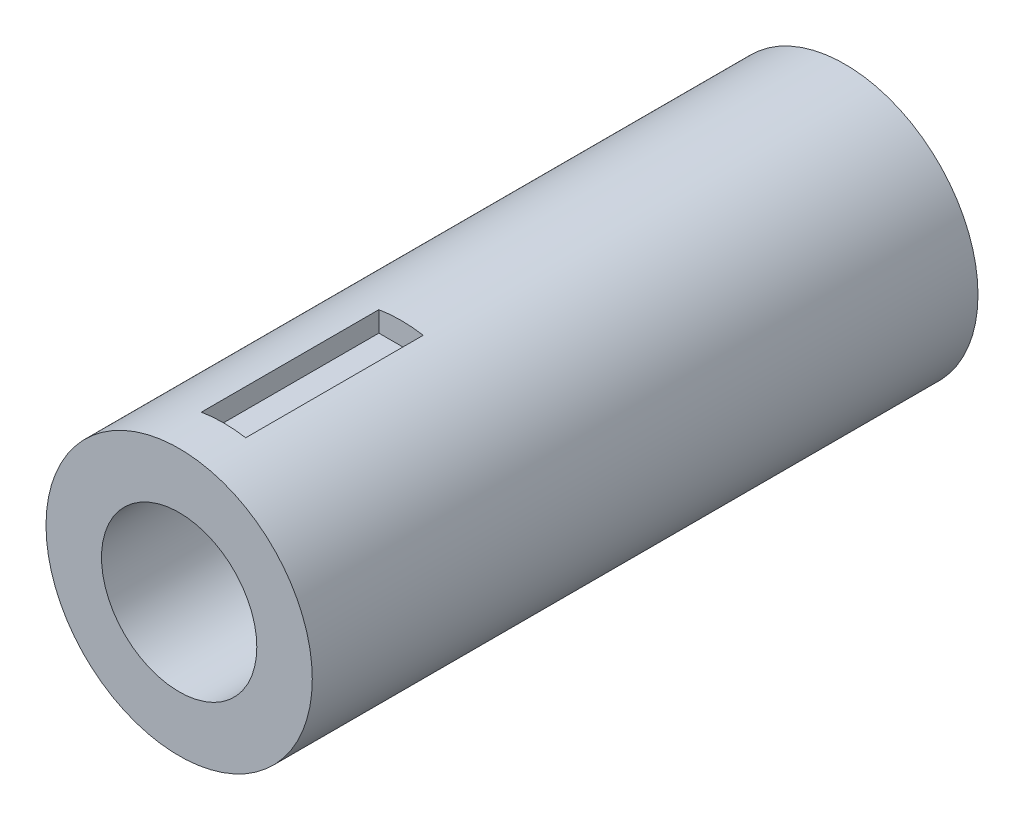
ISO-10303-21;
HEADER;
FILE_DESCRIPTION(('STEP AP214'),'2;1');
FILE_NAME('part.step','',(''),(''),'','','');
FILE_SCHEMA(('AUTOMOTIVE_DESIGN { 1 0 10303 214 1 1 1 1 }'));
ENDSEC;
DATA;
#1=APPLICATION_CONTEXT('core data for automotive mechanical design processes');
#2=APPLICATION_PROTOCOL_DEFINITION('international standard','automotive_design',2000,#1);
#3=PRODUCT_CONTEXT('',#1,'mechanical');
#4=PRODUCT('Part','Part','',(#3));
#5=PRODUCT_RELATED_PRODUCT_CATEGORY('part','',(#4));
#6=PRODUCT_DEFINITION_FORMATION('','',#4);
#7=PRODUCT_DEFINITION_CONTEXT('part definition',#1,'design');
#8=PRODUCT_DEFINITION('design','',#6,#7);
#9=PRODUCT_DEFINITION_SHAPE('','',#8);
#10=(LENGTH_UNIT() NAMED_UNIT(*) SI_UNIT(.MILLI.,.METRE.));
#11=(NAMED_UNIT(*) PLANE_ANGLE_UNIT() SI_UNIT($,.RADIAN.));
#12=(NAMED_UNIT(*) SI_UNIT($,.STERADIAN.) SOLID_ANGLE_UNIT());
#13=UNCERTAINTY_MEASURE_WITH_UNIT(LENGTH_MEASURE(1.E-05),#10,'distance_accuracy_value','');
#14=(GEOMETRIC_REPRESENTATION_CONTEXT(3) GLOBAL_UNCERTAINTY_ASSIGNED_CONTEXT((#13)) GLOBAL_UNIT_ASSIGNED_CONTEXT((#10,
#11,#12)) REPRESENTATION_CONTEXT('',''));
#15=CARTESIAN_POINT('',(0.,0.,0.));
#16=DIRECTION('',(0.,0.,1.));
#17=DIRECTION('',(1.,0.,0.));
#18=AXIS2_PLACEMENT_3D('',#15,#16,#17);
#19=CARTESIAN_POINT('',(0.,0.,-30.));
#20=DIRECTION('',(0.,0.,1.));
#21=DIRECTION('',(1.,0.,0.));
#22=AXIS2_PLACEMENT_3D('',#19,#20,#21);
#23=CYLINDRICAL_SURFACE('',#22,6.);
#24=CARTESIAN_POINT('',(0.,0.,-2.));
#25=DIRECTION('',(0.,0.,1.));
#26=DIRECTION('',(1.,0.,0.));
#27=AXIS2_PLACEMENT_3D('',#24,#25,#26);
#28=CIRCLE('',#27,6.);
#29=CARTESIAN_POINT('',(-1.,5.91607978309962,-2.));
#30=VERTEX_POINT('',#29);
#31=CARTESIAN_POINT('',(1.,5.91607978309962,-2.));
#32=VERTEX_POINT('',#31);
#33=EDGE_CURVE('E119',#30,#32,#28,.F.);
#34=ORIENTED_EDGE('',*,*,#33,.F.);
#35=DIRECTION('',(0.,0.,1.));
#36=VECTOR('',#35,1.);
#37=CARTESIAN_POINT('',(-1.,5.91607978309962,-30.));
#38=LINE('',#37,#36);
#39=CARTESIAN_POINT('',(-1.,5.91607978309962,-10.));
#40=VERTEX_POINT('',#39);
#41=EDGE_CURVE('E11',#40,#30,#38,.T.);
#42=ORIENTED_EDGE('',*,*,#41,.F.);
#43=CARTESIAN_POINT('',(0.,0.,-10.));
#44=DIRECTION('',(0.,0.,-1.));
#45=DIRECTION('',(-1.,0.,0.));
#46=AXIS2_PLACEMENT_3D('',#43,#44,#45);
#47=CIRCLE('',#46,6.);
#48=CARTESIAN_POINT('',(1.,5.91607978309962,-10.));
#49=VERTEX_POINT('',#48);
#50=EDGE_CURVE('E48',#49,#40,#47,.F.);
#51=ORIENTED_EDGE('',*,*,#50,.F.);
#52=DIRECTION('',(0.,0.,1.));
#53=VECTOR('',#52,1.);
#54=CARTESIAN_POINT('',(1.,5.91607978309962,-30.));
#55=LINE('',#54,#53);
#56=EDGE_CURVE('E123',#32,#49,#55,.F.);
#57=ORIENTED_EDGE('',*,*,#56,.F.);
#58=EDGE_LOOP('',(#34,#42,#51,#57));
#59=FACE_BOUND('',#58,.T.);
#60=CARTESIAN_POINT('',(0.,0.,-30.));
#61=DIRECTION('',(0.,0.,1.));
#62=DIRECTION('',(1.,0.,0.));
#63=AXIS2_PLACEMENT_3D('',#60,#61,#62);
#64=CIRCLE('',#63,6.);
#65=CARTESIAN_POINT('',(6.,0.,-30.));
#66=VERTEX_POINT('',#65);
#67=EDGE_CURVE('E116',#66,#66,#64,.T.);
#68=ORIENTED_EDGE('',*,*,#67,.T.);
#69=EDGE_LOOP('',(#68));
#70=FACE_BOUND('',#69,.T.);
#71=CARTESIAN_POINT('',(0.,0.,0.));
#72=DIRECTION('',(0.,0.,1.));
#73=DIRECTION('',(1.,0.,0.));
#74=AXIS2_PLACEMENT_3D('',#71,#72,#73);
#75=CIRCLE('',#74,6.);
#76=CARTESIAN_POINT('',(6.,0.,0.));
#77=VERTEX_POINT('',#76);
#78=EDGE_CURVE('E113',#77,#77,#75,.T.);
#79=ORIENTED_EDGE('',*,*,#78,.F.);
#80=EDGE_LOOP('',(#79));
#81=FACE_BOUND('',#80,.T.);
#82=ADVANCED_FACE('F41',(#59,#70,#81),#23,.T.);
#83=CARTESIAN_POINT('',(0.,0.,-30.));
#84=DIRECTION('',(0.,0.,1.));
#85=DIRECTION('',(1.,0.,0.));
#86=AXIS2_PLACEMENT_3D('',#83,#84,#85);
#87=PLANE('',#86);
#88=CARTESIAN_POINT('',(0.,0.,-30.));
#89=DIRECTION('',(0.,0.,1.));
#90=DIRECTION('',(1.,0.,0.));
#91=AXIS2_PLACEMENT_3D('',#88,#89,#90);
#92=CIRCLE('',#91,3.5);
#93=CARTESIAN_POINT('',(3.5,0.,-30.));
#94=VERTEX_POINT('',#93);
#95=EDGE_CURVE('E110',#94,#94,#92,.T.);
#96=ORIENTED_EDGE('',*,*,#95,.T.);
#97=EDGE_LOOP('',(#96));
#98=FACE_BOUND('',#97,.T.);
#99=ORIENTED_EDGE('',*,*,#67,.F.);
#100=EDGE_LOOP('',(#99));
#101=FACE_BOUND('',#100,.T.);
#102=ADVANCED_FACE('F138',(#98,#101),#87,.F.);
#103=CARTESIAN_POINT('',(0.,0.,0.));
#104=DIRECTION('',(0.,0.,1.));
#105=DIRECTION('',(1.,0.,0.));
#106=AXIS2_PLACEMENT_3D('',#103,#104,#105);
#107=PLANE('',#106);
#108=CARTESIAN_POINT('',(0.,0.,0.));
#109=DIRECTION('',(0.,0.,1.));
#110=DIRECTION('',(1.,0.,0.));
#111=AXIS2_PLACEMENT_3D('',#108,#109,#110);
#112=CIRCLE('',#111,3.5);
#113=CARTESIAN_POINT('',(3.5,0.,0.));
#114=VERTEX_POINT('',#113);
#115=EDGE_CURVE('E105',#114,#114,#112,.T.);
#116=ORIENTED_EDGE('',*,*,#115,.F.);
#117=EDGE_LOOP('',(#116));
#118=FACE_BOUND('',#117,.T.);
#119=ORIENTED_EDGE('',*,*,#78,.T.);
#120=EDGE_LOOP('',(#119));
#121=FACE_BOUND('',#120,.T.);
#122=ADVANCED_FACE('F144',(#118,#121),#107,.T.);
#123=CARTESIAN_POINT('',(0.,0.,-30.));
#124=DIRECTION('',(0.,0.,1.));
#125=DIRECTION('',(1.,0.,0.));
#126=AXIS2_PLACEMENT_3D('',#123,#124,#125);
#127=CYLINDRICAL_SURFACE('',#126,3.5);
#128=ORIENTED_EDGE('',*,*,#95,.F.);
#129=EDGE_LOOP('',(#128));
#130=FACE_BOUND('',#129,.T.);
#131=ORIENTED_EDGE('',*,*,#115,.T.);
#132=EDGE_LOOP('',(#131));
#133=FACE_BOUND('',#132,.T.);
#134=ADVANCED_FACE('F150',(#130,#133),#127,.F.);
#135=CARTESIAN_POINT('',(-1.,5.,-10.));
#136=DIRECTION('',(0.,0.,-1.));
#137=DIRECTION('',(-1.,0.,0.));
#138=AXIS2_PLACEMENT_3D('',#135,#136,#137);
#139=PLANE('',#138);
#140=DIRECTION('',(0.,1.,0.));
#141=VECTOR('',#140,1.);
#142=CARTESIAN_POINT('',(1.,5.,-10.));
#143=LINE('',#142,#141);
#144=CARTESIAN_POINT('',(1.,5.,-10.));
#145=VERTEX_POINT('',#144);
#146=EDGE_CURVE('E103',#145,#49,#143,.T.);
#147=ORIENTED_EDGE('',*,*,#146,.T.);
#148=ORIENTED_EDGE('',*,*,#50,.T.);
#149=DIRECTION('',(0.,1.,0.));
#150=VECTOR('',#149,1.);
#151=CARTESIAN_POINT('',(-1.,5.,-10.));
#152=LINE('',#151,#150);
#153=CARTESIAN_POINT('',(-1.,5.,-10.));
#154=VERTEX_POINT('',#153);
#155=EDGE_CURVE('E54',#154,#40,#152,.T.);
#156=ORIENTED_EDGE('',*,*,#155,.F.);
#157=DIRECTION('',(-1.,0.,0.));
#158=VECTOR('',#157,1.);
#159=CARTESIAN_POINT('',(-1.,5.,-10.));
#160=LINE('',#159,#158);
#161=EDGE_CURVE('E83',#145,#154,#160,.T.);
#162=ORIENTED_EDGE('',*,*,#161,.F.);
#163=EDGE_LOOP('',(#147,#148,#156,#162));
#164=FACE_BOUND('',#163,.T.);
#165=ADVANCED_FACE('F81',(#164),#139,.F.);
#166=CARTESIAN_POINT('',(1.,5.,-10.));
#167=DIRECTION('',(1.,0.,0.));
#168=DIRECTION('',(0.,0.,-1.));
#169=AXIS2_PLACEMENT_3D('',#166,#167,#168);
#170=PLANE('',#169);
#171=ORIENTED_EDGE('',*,*,#56,.T.);
#172=ORIENTED_EDGE('',*,*,#146,.F.);
#173=DIRECTION('',(0.,0.,-1.));
#174=VECTOR('',#173,1.);
#175=CARTESIAN_POINT('',(1.,5.,-10.));
#176=LINE('',#175,#174);
#177=CARTESIAN_POINT('',(1.,5.,-2.));
#178=VERTEX_POINT('',#177);
#179=EDGE_CURVE('E86',#178,#145,#176,.T.);
#180=ORIENTED_EDGE('',*,*,#179,.F.);
#181=DIRECTION('',(0.,1.,0.));
#182=VECTOR('',#181,1.);
#183=CARTESIAN_POINT('',(1.,5.,-2.));
#184=LINE('',#183,#182);
#185=EDGE_CURVE('E106',#178,#32,#184,.T.);
#186=ORIENTED_EDGE('',*,*,#185,.T.);
#187=EDGE_LOOP('',(#171,#172,#180,#186));
#188=FACE_BOUND('',#187,.T.);
#189=ADVANCED_FACE('F125',(#188),#170,.F.);
#190=CARTESIAN_POINT('',(-1.,5.,-2.));
#191=DIRECTION('',(0.,0.,1.));
#192=DIRECTION('',(1.,0.,0.));
#193=AXIS2_PLACEMENT_3D('',#190,#191,#192);
#194=PLANE('',#193);
#195=DIRECTION('',(0.,1.,0.));
#196=VECTOR('',#195,1.);
#197=CARTESIAN_POINT('',(-1.,5.,-2.));
#198=LINE('',#197,#196);
#199=CARTESIAN_POINT('',(-1.,5.,-2.));
#200=VERTEX_POINT('',#199);
#201=EDGE_CURVE('E85',#200,#30,#198,.T.);
#202=ORIENTED_EDGE('',*,*,#201,.T.);
#203=ORIENTED_EDGE('',*,*,#33,.T.);
#204=ORIENTED_EDGE('',*,*,#185,.F.);
#205=DIRECTION('',(1.,0.,0.));
#206=VECTOR('',#205,1.);
#207=CARTESIAN_POINT('',(-1.,5.,-2.));
#208=LINE('',#207,#206);
#209=EDGE_CURVE('E95',#200,#178,#208,.T.);
#210=ORIENTED_EDGE('',*,*,#209,.F.);
#211=EDGE_LOOP('',(#202,#203,#204,#210));
#212=FACE_BOUND('',#211,.T.);
#213=ADVANCED_FACE('F128',(#212),#194,.F.);
#214=CARTESIAN_POINT('',(-1.,5.,-2.));
#215=DIRECTION('',(-1.,0.,0.));
#216=DIRECTION('',(0.,0.,1.));
#217=AXIS2_PLACEMENT_3D('',#214,#215,#216);
#218=PLANE('',#217);
#219=ORIENTED_EDGE('',*,*,#41,.T.);
#220=ORIENTED_EDGE('',*,*,#201,.F.);
#221=DIRECTION('',(0.,0.,1.));
#222=VECTOR('',#221,1.);
#223=CARTESIAN_POINT('',(-1.,5.,-2.));
#224=LINE('',#223,#222);
#225=EDGE_CURVE('E89',#154,#200,#224,.T.);
#226=ORIENTED_EDGE('',*,*,#225,.F.);
#227=ORIENTED_EDGE('',*,*,#155,.T.);
#228=EDGE_LOOP('',(#219,#220,#226,#227));
#229=FACE_BOUND('',#228,.T.);
#230=ADVANCED_FACE('F90',(#229),#218,.F.);
#231=CARTESIAN_POINT('',(0.,5.,0.));
#232=DIRECTION('',(0.,-1.,0.));
#233=DIRECTION('',(0.,0.,-1.));
#234=AXIS2_PLACEMENT_3D('',#231,#232,#233);
#235=PLANE('',#234);
#236=ORIENTED_EDGE('',*,*,#161,.T.);
#237=ORIENTED_EDGE('',*,*,#225,.T.);
#238=ORIENTED_EDGE('',*,*,#209,.T.);
#239=ORIENTED_EDGE('',*,*,#179,.T.);
#240=EDGE_LOOP('',(#236,#237,#238,#239));
#241=FACE_BOUND('',#240,.T.);
#242=ADVANCED_FACE('F97',(#241),#235,.F.);
#243=CLOSED_SHELL('',(#82,#102,#122,#134,#165,#189,#213,#230,#242));
#244=MANIFOLD_SOLID_BREP('B2',#243);
#245=ADVANCED_BREP_SHAPE_REPRESENTATION('',(#18,#244),#14);
#246=SHAPE_DEFINITION_REPRESENTATION(#9,#245);
ENDSEC;
END-ISO-10303-21;
